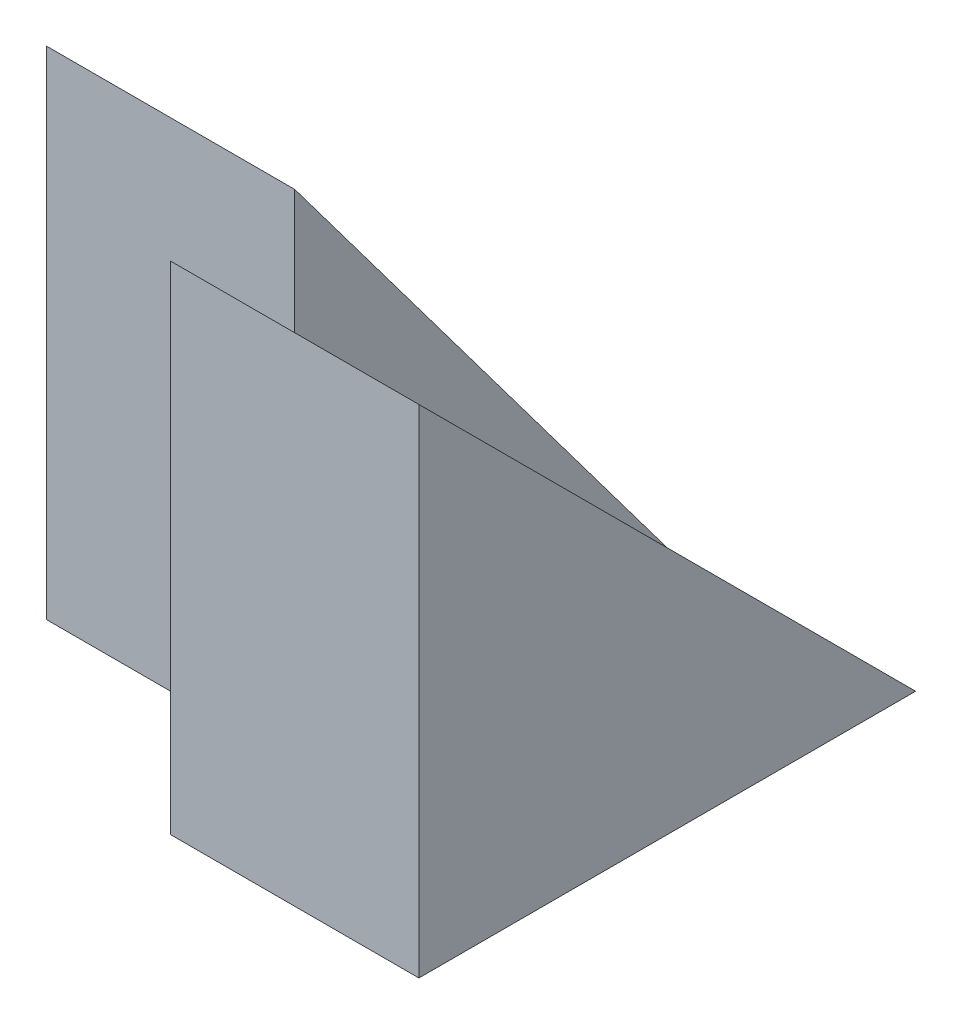
ISO-10303-21;
HEADER;
FILE_DESCRIPTION(('STEP AP214'),'2;1');
FILE_NAME('part.step','',(''),(''),'','','');
FILE_SCHEMA(('AUTOMOTIVE_DESIGN { 1 0 10303 214 1 1 1 1 }'));
ENDSEC;
DATA;
#1=APPLICATION_CONTEXT('core data for automotive mechanical design processes');
#2=APPLICATION_PROTOCOL_DEFINITION('international standard','automotive_design',2000,#1);
#3=PRODUCT_CONTEXT('',#1,'mechanical');
#4=PRODUCT('Part','Part','',(#3));
#5=PRODUCT_RELATED_PRODUCT_CATEGORY('part','',(#4));
#6=PRODUCT_DEFINITION_FORMATION('','',#4);
#7=PRODUCT_DEFINITION_CONTEXT('part definition',#1,'design');
#8=PRODUCT_DEFINITION('design','',#6,#7);
#9=PRODUCT_DEFINITION_SHAPE('','',#8);
#10=(LENGTH_UNIT() NAMED_UNIT(*) SI_UNIT(.MILLI.,.METRE.));
#11=(NAMED_UNIT(*) PLANE_ANGLE_UNIT() SI_UNIT($,.RADIAN.));
#12=(NAMED_UNIT(*) SI_UNIT($,.STERADIAN.) SOLID_ANGLE_UNIT());
#13=UNCERTAINTY_MEASURE_WITH_UNIT(LENGTH_MEASURE(1.E-05),#10,'distance_accuracy_value','');
#14=(GEOMETRIC_REPRESENTATION_CONTEXT(3) GLOBAL_UNCERTAINTY_ASSIGNED_CONTEXT((#13)) GLOBAL_UNIT_ASSIGNED_CONTEXT((#10,
#11,#12)) REPRESENTATION_CONTEXT('',''));
#15=CARTESIAN_POINT('',(0.,0.,0.));
#16=DIRECTION('',(0.,0.,1.));
#17=DIRECTION('',(1.,0.,0.));
#18=AXIS2_PLACEMENT_3D('',#15,#16,#17);
#19=CARTESIAN_POINT('',(2.,0.,0.));
#20=DIRECTION('',(0.,0.,-1.));
#21=DIRECTION('',(-1.,0.,0.));
#22=AXIS2_PLACEMENT_3D('',#19,#20,#21);
#23=PLANE('',#22);
#24=DIRECTION('',(0.,-1.,0.));
#25=VECTOR('',#24,1.);
#26=CARTESIAN_POINT('',(0.,0.,0.));
#27=LINE('',#26,#25);
#28=CARTESIAN_POINT('',(0.,4.,0.));
#29=VERTEX_POINT('',#28);
#30=CARTESIAN_POINT('',(0.,0.,0.));
#31=VERTEX_POINT('',#30);
#32=EDGE_CURVE('E102',#29,#31,#27,.T.);
#33=ORIENTED_EDGE('',*,*,#32,.T.);
#34=DIRECTION('',(-1.,0.,0.));
#35=VECTOR('',#34,1.);
#36=CARTESIAN_POINT('',(2.,0.,0.));
#37=LINE('',#36,#35);
#38=CARTESIAN_POINT('',(2.,0.,0.));
#39=VERTEX_POINT('',#38);
#40=EDGE_CURVE('E11',#39,#31,#37,.T.);
#41=ORIENTED_EDGE('',*,*,#40,.F.);
#42=DIRECTION('',(0.,-1.,0.));
#43=VECTOR('',#42,1.);
#44=CARTESIAN_POINT('',(2.,0.,0.));
#45=LINE('',#44,#43);
#46=CARTESIAN_POINT('',(2.,4.,0.));
#47=VERTEX_POINT('',#46);
#48=EDGE_CURVE('E103',#47,#39,#45,.T.);
#49=ORIENTED_EDGE('',*,*,#48,.F.);
#50=DIRECTION('',(-1.,0.,0.));
#51=VECTOR('',#50,1.);
#52=CARTESIAN_POINT('',(2.,4.,0.));
#53=LINE('',#52,#51);
#54=EDGE_CURVE('E91',#47,#29,#53,.T.);
#55=ORIENTED_EDGE('',*,*,#54,.T.);
#56=EDGE_LOOP('',(#33,#41,#49,#55));
#57=FACE_BOUND('',#56,.T.);
#58=ADVANCED_FACE('F33',(#57),#23,.F.);
#59=CARTESIAN_POINT('',(2.,0.,0.));
#60=DIRECTION('',(0.,1.,0.));
#61=DIRECTION('',(0.,0.,1.));
#62=AXIS2_PLACEMENT_3D('',#59,#60,#61);
#63=PLANE('',#62);
#64=DIRECTION('',(0.,0.,-1.));
#65=VECTOR('',#64,1.);
#66=CARTESIAN_POINT('',(0.,0.,0.));
#67=LINE('',#66,#65);
#68=CARTESIAN_POINT('',(0.,0.,-1.));
#69=VERTEX_POINT('',#68);
#70=EDGE_CURVE('E106',#31,#69,#67,.T.);
#71=ORIENTED_EDGE('',*,*,#70,.T.);
#72=DIRECTION('',(1.,0.,0.));
#73=VECTOR('',#72,1.);
#74=CARTESIAN_POINT('',(-2.,0.,-1.));
#75=LINE('',#74,#73);
#76=CARTESIAN_POINT('',(-2.,0.,-1.));
#77=VERTEX_POINT('',#76);
#78=EDGE_CURVE('E107',#77,#69,#75,.T.);
#79=ORIENTED_EDGE('',*,*,#78,.F.);
#80=DIRECTION('',(0.,0.,1.));
#81=VECTOR('',#80,1.);
#82=CARTESIAN_POINT('',(-2.,0.,-4.));
#83=LINE('',#82,#81);
#84=CARTESIAN_POINT('',(-2.,0.,-4.));
#85=VERTEX_POINT('',#84);
#86=EDGE_CURVE('E121',#85,#77,#83,.T.);
#87=ORIENTED_EDGE('',*,*,#86,.F.);
#88=DIRECTION('',(-1.,0.,0.));
#89=VECTOR('',#88,1.);
#90=CARTESIAN_POINT('',(0.,0.,-4.));
#91=LINE('',#90,#89);
#92=CARTESIAN_POINT('',(0.,0.,-4.));
#93=VERTEX_POINT('',#92);
#94=EDGE_CURVE('E122',#93,#85,#91,.T.);
#95=ORIENTED_EDGE('',*,*,#94,.F.);
#96=DIRECTION('',(-1.,0.,0.));
#97=VECTOR('',#96,1.);
#98=CARTESIAN_POINT('',(2.,0.,-4.));
#99=LINE('',#98,#97);
#100=CARTESIAN_POINT('',(2.,0.,-4.));
#101=VERTEX_POINT('',#100);
#102=EDGE_CURVE('E41',#101,#93,#99,.T.);
#103=ORIENTED_EDGE('',*,*,#102,.F.);
#104=DIRECTION('',(0.,0.,-1.));
#105=VECTOR('',#104,1.);
#106=CARTESIAN_POINT('',(2.,0.,0.));
#107=LINE('',#106,#105);
#108=EDGE_CURVE('E57',#39,#101,#107,.T.);
#109=ORIENTED_EDGE('',*,*,#108,.F.);
#110=ORIENTED_EDGE('',*,*,#40,.T.);
#111=EDGE_LOOP('',(#71,#79,#87,#95,#103,#109,#110));
#112=FACE_BOUND('',#111,.T.);
#113=ADVANCED_FACE('F132',(#112),#63,.F.);
#114=CARTESIAN_POINT('',(2.,0.,0.));
#115=DIRECTION('',(-1.,0.,0.));
#116=DIRECTION('',(0.,0.,1.));
#117=AXIS2_PLACEMENT_3D('',#114,#115,#116);
#118=PLANE('',#117);
#119=ORIENTED_EDGE('',*,*,#108,.T.);
#120=DIRECTION('',(0.,-0.707106781186548,-0.707106781186548));
#121=VECTOR('',#120,1.);
#122=CARTESIAN_POINT('',(2.,0.,-4.));
#123=LINE('',#122,#121);
#124=EDGE_CURVE('E130',#47,#101,#123,.T.);
#125=ORIENTED_EDGE('',*,*,#124,.F.);
#126=ORIENTED_EDGE('',*,*,#48,.T.);
#127=EDGE_LOOP('',(#119,#125,#126));
#128=FACE_BOUND('',#127,.T.);
#129=ADVANCED_FACE('F129',(#128),#118,.F.);
#130=CARTESIAN_POINT('',(0.,0.,0.));
#131=DIRECTION('',(-1.,0.,0.));
#132=DIRECTION('',(0.,0.,1.));
#133=AXIS2_PLACEMENT_3D('',#130,#131,#132);
#134=PLANE('',#133);
#135=DIRECTION('',(0.,-0.707106781186548,-0.707106781186548));
#136=VECTOR('',#135,1.);
#137=CARTESIAN_POINT('',(0.,0.,-4.));
#138=LINE('',#137,#136);
#139=CARTESIAN_POINT('',(0.,3.,-1.));
#140=VERTEX_POINT('',#139);
#141=EDGE_CURVE('E88',#29,#140,#138,.T.);
#142=ORIENTED_EDGE('',*,*,#141,.T.);
#143=DIRECTION('',(0.,1.,0.));
#144=VECTOR('',#143,1.);
#145=CARTESIAN_POINT('',(0.,0.,-1.));
#146=LINE('',#145,#144);
#147=EDGE_CURVE('E49',#69,#140,#146,.T.);
#148=ORIENTED_EDGE('',*,*,#147,.F.);
#149=ORIENTED_EDGE('',*,*,#70,.F.);
#150=ORIENTED_EDGE('',*,*,#32,.F.);
#151=EDGE_LOOP('',(#142,#148,#149,#150));
#152=FACE_BOUND('',#151,.T.);
#153=ADVANCED_FACE('F105',(#152),#134,.T.);
#154=CARTESIAN_POINT('',(-2.,0.,-1.));
#155=DIRECTION('',(0.,0.,-1.));
#156=DIRECTION('',(-1.,0.,0.));
#157=AXIS2_PLACEMENT_3D('',#154,#155,#156);
#158=PLANE('',#157);
#159=ORIENTED_EDGE('',*,*,#147,.T.);
#160=DIRECTION('',(0.,-1.,0.));
#161=VECTOR('',#160,1.);
#162=CARTESIAN_POINT('',(0.,0.,-1.));
#163=LINE('',#162,#161);
#164=CARTESIAN_POINT('',(0.,4.,-1.));
#165=VERTEX_POINT('',#164);
#166=EDGE_CURVE('E96',#165,#140,#163,.T.);
#167=ORIENTED_EDGE('',*,*,#166,.F.);
#168=DIRECTION('',(1.,0.,0.));
#169=VECTOR('',#168,1.);
#170=CARTESIAN_POINT('',(-2.,4.,-1.));
#171=LINE('',#170,#169);
#172=CARTESIAN_POINT('',(-2.,4.,-1.));
#173=VERTEX_POINT('',#172);
#174=EDGE_CURVE('E111',#173,#165,#171,.T.);
#175=ORIENTED_EDGE('',*,*,#174,.F.);
#176=DIRECTION('',(0.,1.,0.));
#177=VECTOR('',#176,1.);
#178=CARTESIAN_POINT('',(-2.,0.,-1.));
#179=LINE('',#178,#177);
#180=EDGE_CURVE('E126',#77,#173,#179,.T.);
#181=ORIENTED_EDGE('',*,*,#180,.F.);
#182=ORIENTED_EDGE('',*,*,#78,.T.);
#183=EDGE_LOOP('',(#159,#167,#175,#181,#182));
#184=FACE_BOUND('',#183,.T.);
#185=ADVANCED_FACE('F159',(#184),#158,.F.);
#186=CARTESIAN_POINT('',(-2.,0.,0.));
#187=DIRECTION('',(-1.,0.,0.));
#188=DIRECTION('',(0.,0.,1.));
#189=AXIS2_PLACEMENT_3D('',#186,#187,#188);
#190=PLANE('',#189);
#191=DIRECTION('',(0.,0.8,0.6));
#192=VECTOR('',#191,1.);
#193=CARTESIAN_POINT('',(-2.,4.,-1.));
#194=LINE('',#193,#192);
#195=EDGE_CURVE('E144',#85,#173,#194,.T.);
#196=ORIENTED_EDGE('',*,*,#195,.F.);
#197=ORIENTED_EDGE('',*,*,#86,.T.);
#198=ORIENTED_EDGE('',*,*,#180,.T.);
#199=EDGE_LOOP('',(#196,#197,#198));
#200=FACE_BOUND('',#199,.T.);
#201=ADVANCED_FACE('F157',(#200),#190,.T.);
#202=CARTESIAN_POINT('',(0.,4.,-1.));
#203=DIRECTION('',(0.,-0.6,0.8));
#204=DIRECTION('',(0.,-0.8,-0.6));
#205=AXIS2_PLACEMENT_3D('',#202,#203,#204);
#206=PLANE('',#205);
#207=ORIENTED_EDGE('',*,*,#195,.T.);
#208=ORIENTED_EDGE('',*,*,#174,.T.);
#209=DIRECTION('',(0.,0.8,0.6));
#210=VECTOR('',#209,1.);
#211=CARTESIAN_POINT('',(0.,4.,-1.));
#212=LINE('',#211,#210);
#213=EDGE_CURVE('E137',#93,#165,#212,.T.);
#214=ORIENTED_EDGE('',*,*,#213,.F.);
#215=ORIENTED_EDGE('',*,*,#94,.T.);
#216=EDGE_LOOP('',(#207,#208,#214,#215));
#217=FACE_BOUND('',#216,.T.);
#218=ADVANCED_FACE('F141',(#217),#206,.F.);
#219=CARTESIAN_POINT('',(0.,0.,0.));
#220=DIRECTION('',(1.,0.,0.));
#221=DIRECTION('',(0.,0.,-1.));
#222=AXIS2_PLACEMENT_3D('',#219,#220,#221);
#223=PLANE('',#222);
#224=ORIENTED_EDGE('',*,*,#166,.T.);
#225=EDGE_CURVE('E94',#140,#93,#138,.T.);
#226=ORIENTED_EDGE('',*,*,#225,.T.);
#227=ORIENTED_EDGE('',*,*,#213,.T.);
#228=EDGE_LOOP('',(#224,#226,#227));
#229=FACE_BOUND('',#228,.T.);
#230=ADVANCED_FACE('F136',(#229),#223,.T.);
#231=CARTESIAN_POINT('',(0.,0.,-4.));
#232=DIRECTION('',(0.,-0.707106781186547,0.707106781186547));
#233=DIRECTION('',(0.,-0.707106781186548,-0.707106781186548));
#234=AXIS2_PLACEMENT_3D('',#231,#232,#233);
#235=PLANE('',#234);
#236=ORIENTED_EDGE('',*,*,#124,.T.);
#237=ORIENTED_EDGE('',*,*,#102,.T.);
#238=ORIENTED_EDGE('',*,*,#225,.F.);
#239=ORIENTED_EDGE('',*,*,#141,.F.);
#240=ORIENTED_EDGE('',*,*,#54,.F.);
#241=EDGE_LOOP('',(#236,#237,#238,#239,#240));
#242=FACE_BOUND('',#241,.T.);
#243=ADVANCED_FACE('F90',(#242),#235,.F.);
#244=CLOSED_SHELL('',(#58,#113,#129,#153,#185,#201,#218,#230,#243));
#245=MANIFOLD_SOLID_BREP('B2',#244);
#246=ADVANCED_BREP_SHAPE_REPRESENTATION('',(#18,#245),#14);
#247=SHAPE_DEFINITION_REPRESENTATION(#9,#246);
ENDSEC;
END-ISO-10303-21;
